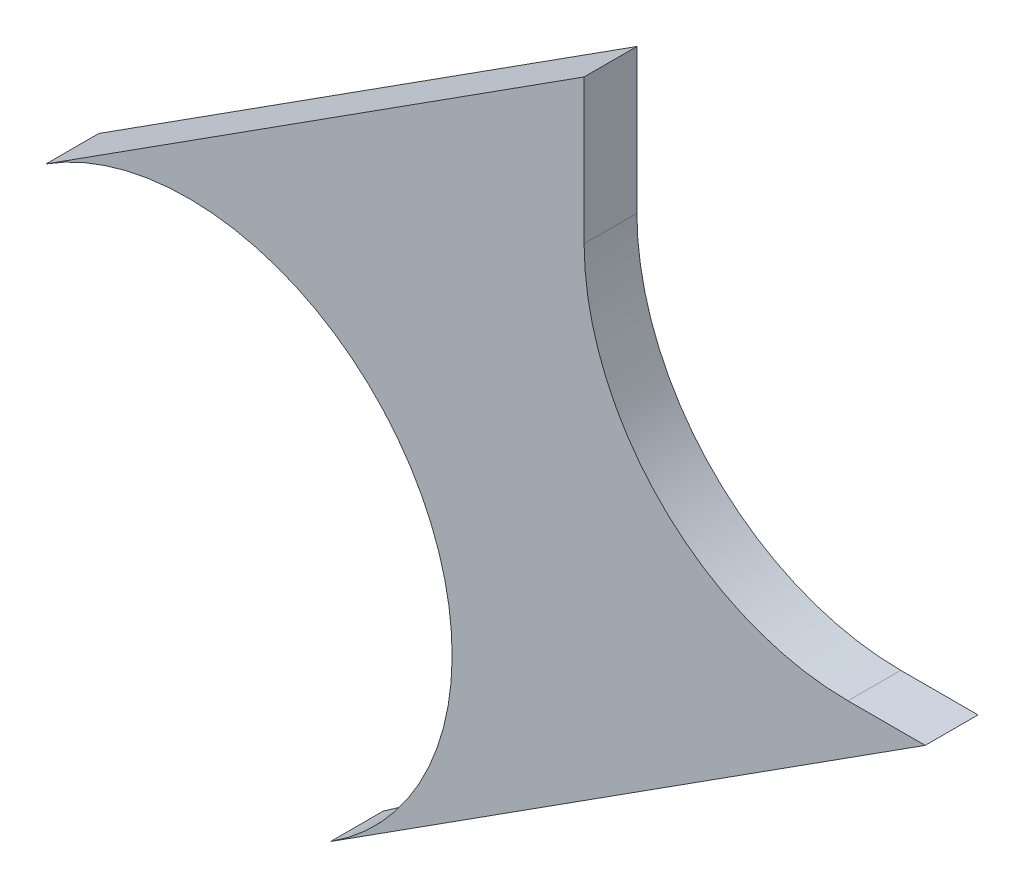
ISO-10303-21;
HEADER;
FILE_DESCRIPTION(('STEP AP214'),'2;1');
FILE_NAME('part.step','',(''),(''),'','','');
FILE_SCHEMA(('AUTOMOTIVE_DESIGN { 1 0 10303 214 1 1 1 1 }'));
ENDSEC;
DATA;
#1=APPLICATION_CONTEXT('core data for automotive mechanical design processes');
#2=APPLICATION_PROTOCOL_DEFINITION('international standard','automotive_design',2000,#1);
#3=PRODUCT_CONTEXT('',#1,'mechanical');
#4=PRODUCT('Part','Part','',(#3));
#5=PRODUCT_RELATED_PRODUCT_CATEGORY('part','',(#4));
#6=PRODUCT_DEFINITION_FORMATION('','',#4);
#7=PRODUCT_DEFINITION_CONTEXT('part definition',#1,'design');
#8=PRODUCT_DEFINITION('design','',#6,#7);
#9=PRODUCT_DEFINITION_SHAPE('','',#8);
#10=(LENGTH_UNIT() NAMED_UNIT(*) SI_UNIT(.MILLI.,.METRE.));
#11=(NAMED_UNIT(*) PLANE_ANGLE_UNIT() SI_UNIT($,.RADIAN.));
#12=(NAMED_UNIT(*) SI_UNIT($,.STERADIAN.) SOLID_ANGLE_UNIT());
#13=UNCERTAINTY_MEASURE_WITH_UNIT(LENGTH_MEASURE(1.E-05),#10,'distance_accuracy_value','');
#14=(GEOMETRIC_REPRESENTATION_CONTEXT(3) GLOBAL_UNCERTAINTY_ASSIGNED_CONTEXT((#13)) GLOBAL_UNIT_ASSIGNED_CONTEXT((#10,
#11,#12)) REPRESENTATION_CONTEXT('',''));
#15=CARTESIAN_POINT('',(0.,0.,0.));
#16=DIRECTION('',(0.,0.,1.));
#17=DIRECTION('',(1.,0.,0.));
#18=AXIS2_PLACEMENT_3D('',#15,#16,#17);
#19=CARTESIAN_POINT('',(-1653.47201946472,172.72,148.59));
#20=DIRECTION('',(0.,0.,-1.));
#21=DIRECTION('',(-1.,0.,0.));
#22=AXIS2_PLACEMENT_3D('',#19,#20,#21);
#23=CYLINDRICAL_SURFACE('',#22,12.6999999999999);
#24=CARTESIAN_POINT('',(-1653.47201946472,172.72,146.05));
#25=DIRECTION('',(0.,0.,1.));
#26=DIRECTION('',(1.,0.,0.));
#27=AXIS2_PLACEMENT_3D('',#24,#25,#26);
#28=CIRCLE('',#27,12.6999999999999);
#29=CARTESIAN_POINT('',(-1666.17201946472,172.72,146.05));
#30=VERTEX_POINT('',#29);
#31=CARTESIAN_POINT('',(-1653.47201946472,160.02,146.05));
#32=VERTEX_POINT('',#31);
#33=EDGE_CURVE('E119',#30,#32,#28,.T.);
#34=ORIENTED_EDGE('',*,*,#33,.F.);
#35=DIRECTION('',(0.,0.,-1.));
#36=VECTOR('',#35,1.);
#37=CARTESIAN_POINT('',(-1666.17201946472,172.72,148.59));
#38=LINE('',#37,#36);
#39=CARTESIAN_POINT('',(-1666.17201946472,172.72,148.59));
#40=VERTEX_POINT('',#39);
#41=EDGE_CURVE('E11',#40,#30,#38,.T.);
#42=ORIENTED_EDGE('',*,*,#41,.F.);
#43=CARTESIAN_POINT('',(-1653.47201946472,172.72,148.59));
#44=DIRECTION('',(0.,0.,1.));
#45=DIRECTION('',(1.,0.,0.));
#46=AXIS2_PLACEMENT_3D('',#43,#44,#45);
#47=CIRCLE('',#46,12.6999999999999);
#48=CARTESIAN_POINT('',(-1653.47201946472,160.02,148.59));
#49=VERTEX_POINT('',#48);
#50=EDGE_CURVE('E133',#40,#49,#47,.T.);
#51=ORIENTED_EDGE('',*,*,#50,.T.);
#52=DIRECTION('',(0.,0.,-1.));
#53=VECTOR('',#52,1.);
#54=CARTESIAN_POINT('',(-1653.47201946472,160.02,148.59));
#55=LINE('',#54,#53);
#56=EDGE_CURVE('E52',#49,#32,#55,.T.);
#57=ORIENTED_EDGE('',*,*,#56,.T.);
#58=EDGE_LOOP('',(#34,#42,#51,#57));
#59=FACE_BOUND('',#58,.T.);
#60=ADVANCED_FACE('F36',(#59),#23,.F.);
#61=CARTESIAN_POINT('',(-1666.17201946472,0.,148.59));
#62=DIRECTION('',(-1.,0.,0.));
#63=DIRECTION('',(0.,0.,1.));
#64=AXIS2_PLACEMENT_3D('',#61,#62,#63);
#65=PLANE('',#64);
#66=DIRECTION('',(0.,1.,0.));
#67=VECTOR('',#66,1.);
#68=CARTESIAN_POINT('',(-1666.17201946472,0.,146.05));
#69=LINE('',#68,#67);
#70=CARTESIAN_POINT('',(-1666.17201946472,179.67027523293,146.05));
#71=VERTEX_POINT('',#70);
#72=EDGE_CURVE('E121',#30,#71,#69,.T.);
#73=ORIENTED_EDGE('',*,*,#72,.T.);
#74=DIRECTION('',(0.,0.,-1.));
#75=VECTOR('',#74,1.);
#76=CARTESIAN_POINT('',(-1666.17201946472,179.67027523293,148.59));
#77=LINE('',#76,#75);
#78=CARTESIAN_POINT('',(-1666.17201946472,179.67027523293,148.59));
#79=VERTEX_POINT('',#78);
#80=EDGE_CURVE('E44',#79,#71,#77,.T.);
#81=ORIENTED_EDGE('',*,*,#80,.F.);
#82=DIRECTION('',(0.,1.,0.));
#83=VECTOR('',#82,1.);
#84=CARTESIAN_POINT('',(-1666.17201946472,0.,148.59));
#85=LINE('',#84,#83);
#86=EDGE_CURVE('E114',#40,#79,#85,.T.);
#87=ORIENTED_EDGE('',*,*,#86,.F.);
#88=ORIENTED_EDGE('',*,*,#41,.T.);
#89=EDGE_LOOP('',(#73,#81,#87,#88));
#90=FACE_BOUND('',#89,.T.);
#91=ADVANCED_FACE('F142',(#90),#65,.F.);
#92=CARTESIAN_POINT('',(-565.730019382671,883.953155285434,148.59));
#93=DIRECTION('',(-0.539053696423363,0.842271400661515,0.));
#94=DIRECTION('',(-0.842271400661515,-0.539053696423363,0.));
#95=AXIS2_PLACEMENT_3D('',#92,#93,#94);
#96=PLANE('',#95);
#97=DIRECTION('',(0.842271400661515,0.539053696423363,0.));
#98=VECTOR('',#97,1.);
#99=CARTESIAN_POINT('',(-565.730019382671,883.953155285434,146.05));
#100=LINE('',#99,#98);
#101=CARTESIAN_POINT('',(-1692.0680014093,163.096846788401,146.05));
#102=VERTEX_POINT('',#101);
#103=EDGE_CURVE('E124',#102,#71,#100,.T.);
#104=ORIENTED_EDGE('',*,*,#103,.F.);
#105=DIRECTION('',(0.,0.,-1.));
#106=VECTOR('',#105,1.);
#107=CARTESIAN_POINT('',(-1692.0680014093,163.096846788401,148.59));
#108=LINE('',#107,#106);
#109=CARTESIAN_POINT('',(-1692.0680014093,163.096846788401,148.59));
#110=VERTEX_POINT('',#109);
#111=EDGE_CURVE('E100',#110,#102,#108,.T.);
#112=ORIENTED_EDGE('',*,*,#111,.F.);
#113=DIRECTION('',(0.842271400661515,0.539053696423363,0.));
#114=VECTOR('',#113,1.);
#115=CARTESIAN_POINT('',(-565.730019382671,883.953155285434,148.59));
#116=LINE('',#115,#114);
#117=EDGE_CURVE('E112',#110,#79,#116,.T.);
#118=ORIENTED_EDGE('',*,*,#117,.T.);
#119=ORIENTED_EDGE('',*,*,#80,.T.);
#120=EDGE_LOOP('',(#104,#112,#118,#119));
#121=FACE_BOUND('',#120,.T.);
#122=ADVANCED_FACE('F139',(#121),#96,.T.);
#123=CARTESIAN_POINT('',(-1685.22201946472,152.4,148.59));
#124=DIRECTION('',(0.,0.,-1.));
#125=DIRECTION('',(-1.,0.,0.));
#126=AXIS2_PLACEMENT_3D('',#123,#124,#125);
#127=CYLINDRICAL_SURFACE('',#126,12.7000000000001);
#128=CARTESIAN_POINT('',(-1685.22201946472,152.4,146.05));
#129=DIRECTION('',(0.,0.,1.));
#130=DIRECTION('',(1.,0.,0.));
#131=AXIS2_PLACEMENT_3D('',#128,#129,#130);
#132=CIRCLE('',#131,12.7000000000001);
#133=CARTESIAN_POINT('',(-1678.37603752014,141.703153211599,146.05));
#134=VERTEX_POINT('',#133);
#135=EDGE_CURVE('E97',#134,#102,#132,.T.);
#136=ORIENTED_EDGE('',*,*,#135,.F.);
#137=DIRECTION('',(0.,0.,-1.));
#138=VECTOR('',#137,1.);
#139=CARTESIAN_POINT('',(-1678.37603752014,141.703153211599,148.59));
#140=LINE('',#139,#138);
#141=CARTESIAN_POINT('',(-1678.37603752014,141.703153211599,148.59));
#142=VERTEX_POINT('',#141);
#143=EDGE_CURVE('E91',#142,#134,#140,.T.);
#144=ORIENTED_EDGE('',*,*,#143,.F.);
#145=CARTESIAN_POINT('',(-1685.22201946472,152.4,148.59));
#146=DIRECTION('',(0.,0.,1.));
#147=DIRECTION('',(1.,0.,0.));
#148=AXIS2_PLACEMENT_3D('',#145,#146,#147);
#149=CIRCLE('',#148,12.7000000000001);
#150=EDGE_CURVE('E95',#142,#110,#149,.T.);
#151=ORIENTED_EDGE('',*,*,#150,.T.);
#152=ORIENTED_EDGE('',*,*,#111,.T.);
#153=EDGE_LOOP('',(#136,#144,#151,#152));
#154=FACE_BOUND('',#153,.T.);
#155=ADVANCED_FACE('F93',(#154),#127,.F.);
#156=CARTESIAN_POINT('',(-552.038055493518,862.559461708631,148.59));
#157=DIRECTION('',(-0.539053696423364,0.842271400661514,0.));
#158=DIRECTION('',(-0.842271400661514,-0.539053696423364,0.));
#159=AXIS2_PLACEMENT_3D('',#156,#157,#158);
#160=PLANE('',#159);
#161=DIRECTION('',(0.842271400661514,0.539053696423364,0.));
#162=VECTOR('',#161,1.);
#163=CARTESIAN_POINT('',(-552.038055493518,862.559461708631,146.05));
#164=LINE('',#163,#162);
#165=CARTESIAN_POINT('',(-1649.75596441326,160.02,146.05));
#166=VERTEX_POINT('',#165);
#167=EDGE_CURVE('E128',#134,#166,#164,.T.);
#168=ORIENTED_EDGE('',*,*,#167,.T.);
#169=DIRECTION('',(0.,0.,-1.));
#170=VECTOR('',#169,1.);
#171=CARTESIAN_POINT('',(-1649.75596441326,160.02,148.59));
#172=LINE('',#171,#170);
#173=CARTESIAN_POINT('',(-1649.75596441326,160.02,148.59));
#174=VERTEX_POINT('',#173);
#175=EDGE_CURVE('E72',#174,#166,#172,.T.);
#176=ORIENTED_EDGE('',*,*,#175,.F.);
#177=DIRECTION('',(0.842271400661514,0.539053696423364,0.));
#178=VECTOR('',#177,1.);
#179=CARTESIAN_POINT('',(-552.038055493518,862.559461708631,148.59));
#180=LINE('',#179,#178);
#181=EDGE_CURVE('E102',#142,#174,#180,.T.);
#182=ORIENTED_EDGE('',*,*,#181,.F.);
#183=ORIENTED_EDGE('',*,*,#143,.T.);
#184=EDGE_LOOP('',(#168,#176,#182,#183));
#185=FACE_BOUND('',#184,.T.);
#186=ADVANCED_FACE('F103',(#185),#160,.F.);
#187=CARTESIAN_POINT('',(4.44089209850063E-13,160.02,148.59));
#188=DIRECTION('',(0.,1.,0.));
#189=DIRECTION('',(0.,0.,1.));
#190=AXIS2_PLACEMENT_3D('',#187,#188,#189);
#191=PLANE('',#190);
#192=DIRECTION('',(1.,0.,0.));
#193=VECTOR('',#192,1.);
#194=CARTESIAN_POINT('',(4.44089209850063E-13,160.02,146.05));
#195=LINE('',#194,#193);
#196=EDGE_CURVE('E130',#32,#166,#195,.T.);
#197=ORIENTED_EDGE('',*,*,#196,.F.);
#198=ORIENTED_EDGE('',*,*,#56,.F.);
#199=DIRECTION('',(1.,0.,0.));
#200=VECTOR('',#199,1.);
#201=CARTESIAN_POINT('',(4.44089209850063E-13,160.02,148.59));
#202=LINE('',#201,#200);
#203=EDGE_CURVE('E106',#49,#174,#202,.T.);
#204=ORIENTED_EDGE('',*,*,#203,.T.);
#205=ORIENTED_EDGE('',*,*,#175,.T.);
#206=EDGE_LOOP('',(#197,#198,#204,#205));
#207=FACE_BOUND('',#206,.T.);
#208=ADVANCED_FACE('F145',(#207),#191,.T.);
#209=CARTESIAN_POINT('',(4.44089209850063E-13,-1.11022302462516E-13,148.59));
#210=DIRECTION('',(0.,0.,1.));
#211=DIRECTION('',(1.,0.,0.));
#212=AXIS2_PLACEMENT_3D('',#209,#210,#211);
#213=PLANE('',#212);
#214=ORIENTED_EDGE('',*,*,#50,.F.);
#215=ORIENTED_EDGE('',*,*,#86,.T.);
#216=ORIENTED_EDGE('',*,*,#117,.F.);
#217=ORIENTED_EDGE('',*,*,#150,.F.);
#218=ORIENTED_EDGE('',*,*,#181,.T.);
#219=ORIENTED_EDGE('',*,*,#203,.F.);
#220=EDGE_LOOP('',(#214,#215,#216,#217,#218,#219));
#221=FACE_BOUND('',#220,.T.);
#222=ADVANCED_FACE('F110',(#221),#213,.T.);
#223=CARTESIAN_POINT('',(4.44089209850063E-13,-1.11022302462516E-13,146.05));
#224=DIRECTION('',(0.,0.,1.));
#225=DIRECTION('',(1.,0.,0.));
#226=AXIS2_PLACEMENT_3D('',#223,#224,#225);
#227=PLANE('',#226);
#228=ORIENTED_EDGE('',*,*,#33,.T.);
#229=ORIENTED_EDGE('',*,*,#196,.T.);
#230=ORIENTED_EDGE('',*,*,#167,.F.);
#231=ORIENTED_EDGE('',*,*,#135,.T.);
#232=ORIENTED_EDGE('',*,*,#103,.T.);
#233=ORIENTED_EDGE('',*,*,#72,.F.);
#234=EDGE_LOOP('',(#228,#229,#230,#231,#232,#233));
#235=FACE_BOUND('',#234,.T.);
#236=ADVANCED_FACE('F144',(#235),#227,.F.);
#237=CLOSED_SHELL('',(#60,#91,#122,#155,#186,#208,#222,#236));
#238=MANIFOLD_SOLID_BREP('B2',#237);
#239=ADVANCED_BREP_SHAPE_REPRESENTATION('',(#18,#238),#14);
#240=SHAPE_DEFINITION_REPRESENTATION(#9,#239);
ENDSEC;
END-ISO-10303-21;
